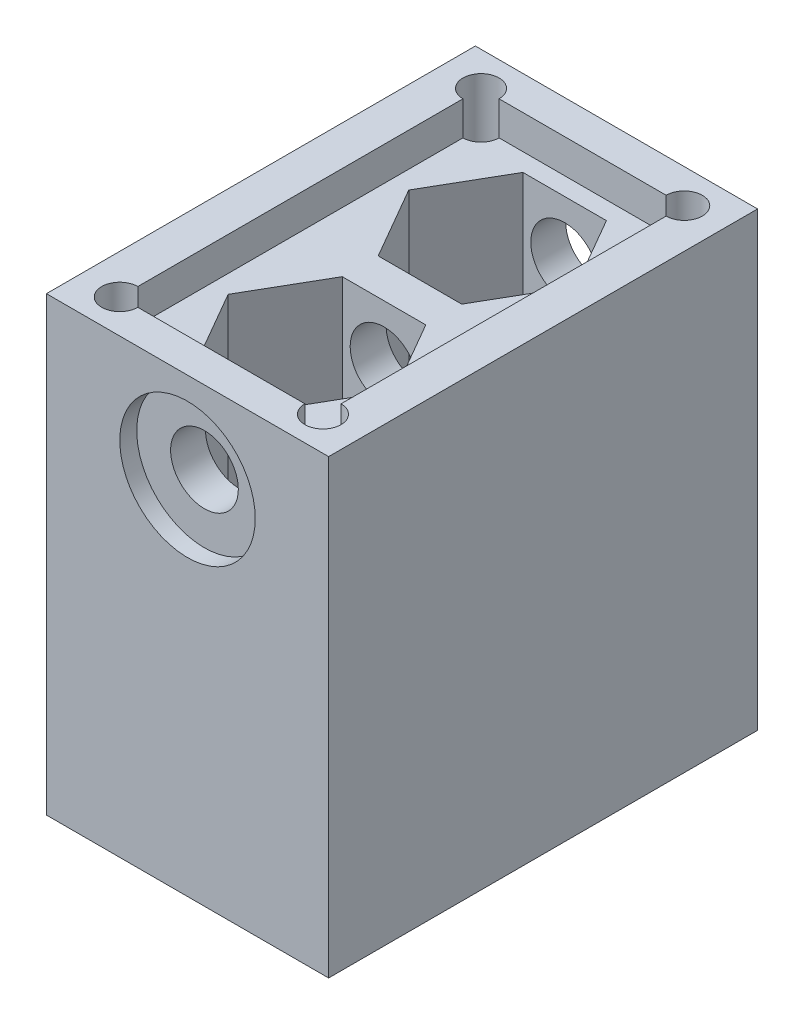
ISO-10303-21;
HEADER;
FILE_DESCRIPTION(('STEP AP214'),'2;1');
FILE_NAME('part.step','',(''),(''),'','','');
FILE_SCHEMA(('AUTOMOTIVE_DESIGN { 1 0 10303 214 1 1 1 1 }'));
ENDSEC;
DATA;
#1=APPLICATION_CONTEXT('core data for automotive mechanical design processes');
#2=APPLICATION_PROTOCOL_DEFINITION('international standard','automotive_design',2000,#1);
#3=PRODUCT_CONTEXT('',#1,'mechanical');
#4=PRODUCT('Part','Part','',(#3));
#5=PRODUCT_RELATED_PRODUCT_CATEGORY('part','',(#4));
#6=PRODUCT_DEFINITION_FORMATION('','',#4);
#7=PRODUCT_DEFINITION_CONTEXT('part definition',#1,'design');
#8=PRODUCT_DEFINITION('design','',#6,#7);
#9=PRODUCT_DEFINITION_SHAPE('','',#8);
#10=(LENGTH_UNIT() NAMED_UNIT(*) SI_UNIT(.MILLI.,.METRE.));
#11=(NAMED_UNIT(*) PLANE_ANGLE_UNIT() SI_UNIT($,.RADIAN.));
#12=(NAMED_UNIT(*) SI_UNIT($,.STERADIAN.) SOLID_ANGLE_UNIT());
#13=UNCERTAINTY_MEASURE_WITH_UNIT(LENGTH_MEASURE(1.E-05),#10,'distance_accuracy_value','');
#14=(GEOMETRIC_REPRESENTATION_CONTEXT(3) GLOBAL_UNCERTAINTY_ASSIGNED_CONTEXT((#13)) GLOBAL_UNIT_ASSIGNED_CONTEXT((#10,
#11,#12)) REPRESENTATION_CONTEXT('',''));
#15=CARTESIAN_POINT('',(0.,0.,0.));
#16=DIRECTION('',(0.,0.,1.));
#17=DIRECTION('',(1.,0.,0.));
#18=AXIS2_PLACEMENT_3D('',#15,#16,#17);
#19=CARTESIAN_POINT('',(0.,32.,-19.));
#20=DIRECTION('',(0.,0.,1.));
#21=DIRECTION('',(1.,0.,0.));
#22=AXIS2_PLACEMENT_3D('',#19,#20,#21);
#23=CYLINDRICAL_SURFACE('',#22,3.);
#24=CARTESIAN_POINT('',(0.,32.,14.4085879880048));
#25=DIRECTION('',(0.,0.,1.));
#26=DIRECTION('',(1.,0.,0.));
#27=AXIS2_PLACEMENT_3D('',#24,#25,#26);
#28=CIRCLE('',#27,3.);
#29=CARTESIAN_POINT('',(3.,32.,14.4085879880048));
#30=VERTEX_POINT('',#29);
#31=EDGE_CURVE('E319',#30,#30,#28,.F.);
#32=ORIENTED_EDGE('',*,*,#31,.T.);
#33=EDGE_LOOP('',(#32));
#34=FACE_BOUND('',#33,.T.);
#35=CARTESIAN_POINT('',(0.,32.,17.5));
#36=DIRECTION('',(0.,0.,1.));
#37=DIRECTION('',(1.,0.,0.));
#38=AXIS2_PLACEMENT_3D('',#35,#36,#37);
#39=CIRCLE('',#38,3.);
#40=CARTESIAN_POINT('',(3.,32.,17.5));
#41=VERTEX_POINT('',#40);
#42=EDGE_CURVE('E38',#41,#41,#39,.F.);
#43=ORIENTED_EDGE('',*,*,#42,.F.);
#44=EDGE_LOOP('',(#43));
#45=FACE_BOUND('',#44,.T.);
#46=ADVANCED_FACE('F34',(#34,#45),#23,.F.);
#47=CARTESIAN_POINT('',(0.,32.,-14.4085879880049));
#48=DIRECTION('',(0.,0.,-1.));
#49=DIRECTION('',(-1.,0.,0.));
#50=AXIS2_PLACEMENT_3D('',#47,#48,#49);
#51=CIRCLE('',#50,3.);
#52=CARTESIAN_POINT('',(-3.,32.,-14.4085879880049));
#53=VERTEX_POINT('',#52);
#54=EDGE_CURVE('E275',#53,#53,#51,.F.);
#55=ORIENTED_EDGE('',*,*,#54,.T.);
#56=EDGE_LOOP('',(#55));
#57=FACE_BOUND('',#56,.T.);
#58=CARTESIAN_POINT('',(0.,32.,-17.5));
#59=DIRECTION('',(0.,0.,-1.));
#60=DIRECTION('',(-1.,0.,0.));
#61=AXIS2_PLACEMENT_3D('',#58,#59,#60);
#62=CIRCLE('',#61,3.);
#63=CARTESIAN_POINT('',(-3.,32.,-17.5));
#64=VERTEX_POINT('',#63);
#65=EDGE_CURVE('E219',#64,#64,#62,.F.);
#66=ORIENTED_EDGE('',*,*,#65,.F.);
#67=EDGE_LOOP('',(#66));
#68=FACE_BOUND('',#67,.T.);
#69=ADVANCED_FACE('F480',(#57,#68),#23,.F.);
#70=CARTESIAN_POINT('',(3.70000000000001,22.,1.59141201199515));
#71=DIRECTION('',(0.,0.,-1.));
#72=DIRECTION('',(-1.,0.,0.));
#73=AXIS2_PLACEMENT_3D('',#70,#71,#72);
#74=PLANE('',#73);
#75=CARTESIAN_POINT('',(0.,32.,1.59141201199515));
#76=DIRECTION('',(0.,0.,-1.));
#77=DIRECTION('',(-1.,0.,0.));
#78=AXIS2_PLACEMENT_3D('',#75,#76,#77);
#79=CIRCLE('',#78,3.);
#80=CARTESIAN_POINT('',(-3.,32.,1.59141201199515));
#81=VERTEX_POINT('',#80);
#82=EDGE_CURVE('E315',#81,#81,#79,.F.);
#83=ORIENTED_EDGE('',*,*,#82,.F.);
#84=EDGE_LOOP('',(#83));
#85=FACE_BOUND('',#84,.T.);
#86=DIRECTION('',(1.,0.,0.));
#87=VECTOR('',#86,1.);
#88=CARTESIAN_POINT('',(3.70000000000001,37.,1.59141201199515));
#89=LINE('',#88,#87);
#90=CARTESIAN_POINT('',(-3.7,37.,1.59141201199515));
#91=VERTEX_POINT('',#90);
#92=CARTESIAN_POINT('',(3.70000000000001,37.,1.59141201199515));
#93=VERTEX_POINT('',#92);
#94=EDGE_CURVE('E421',#91,#93,#89,.T.);
#95=ORIENTED_EDGE('',*,*,#94,.F.);
#96=DIRECTION('',(0.,1.,0.));
#97=VECTOR('',#96,1.);
#98=CARTESIAN_POINT('',(-3.7,22.,1.59141201199515));
#99=LINE('',#98,#97);
#100=CARTESIAN_POINT('',(-3.7,22.,1.59141201199515));
#101=VERTEX_POINT('',#100);
#102=EDGE_CURVE('E301',#101,#91,#99,.T.);
#103=ORIENTED_EDGE('',*,*,#102,.F.);
#104=DIRECTION('',(-1.,0.,0.));
#105=VECTOR('',#104,1.);
#106=CARTESIAN_POINT('',(3.70000000000001,22.,1.59141201199515));
#107=LINE('',#106,#105);
#108=CARTESIAN_POINT('',(3.70000000000001,22.,1.59141201199515));
#109=VERTEX_POINT('',#108);
#110=EDGE_CURVE('E290',#109,#101,#107,.T.);
#111=ORIENTED_EDGE('',*,*,#110,.F.);
#112=DIRECTION('',(0.,1.,0.));
#113=VECTOR('',#112,1.);
#114=CARTESIAN_POINT('',(3.70000000000001,22.,1.59141201199515));
#115=LINE('',#114,#113);
#116=EDGE_CURVE('E304',#109,#93,#115,.T.);
#117=ORIENTED_EDGE('',*,*,#116,.T.);
#118=EDGE_LOOP('',(#95,#103,#111,#117));
#119=FACE_BOUND('',#118,.T.);
#120=ADVANCED_FACE('F487',(#85,#119),#74,.F.);
#121=CARTESIAN_POINT('',(-3.69999999999999,22.,14.4085879880048));
#122=DIRECTION('',(0.,0.,1.));
#123=DIRECTION('',(1.,0.,0.));
#124=AXIS2_PLACEMENT_3D('',#121,#122,#123);
#125=PLANE('',#124);
#126=ORIENTED_EDGE('',*,*,#31,.F.);
#127=EDGE_LOOP('',(#126));
#128=FACE_BOUND('',#127,.T.);
#129=DIRECTION('',(-1.,0.,0.));
#130=VECTOR('',#129,1.);
#131=CARTESIAN_POINT('',(-3.69999999999999,37.,14.4085879880048));
#132=LINE('',#131,#130);
#133=CARTESIAN_POINT('',(3.70000000000001,37.,14.4085879880048));
#134=VERTEX_POINT('',#133);
#135=CARTESIAN_POINT('',(-3.69999999999999,37.,14.4085879880048));
#136=VERTEX_POINT('',#135);
#137=EDGE_CURVE('E419',#134,#136,#132,.T.);
#138=ORIENTED_EDGE('',*,*,#137,.F.);
#139=DIRECTION('',(0.,1.,0.));
#140=VECTOR('',#139,1.);
#141=CARTESIAN_POINT('',(3.70000000000001,22.,14.4085879880048));
#142=LINE('',#141,#140);
#143=CARTESIAN_POINT('',(3.70000000000001,22.,14.4085879880048));
#144=VERTEX_POINT('',#143);
#145=EDGE_CURVE('E310',#144,#134,#142,.T.);
#146=ORIENTED_EDGE('',*,*,#145,.F.);
#147=DIRECTION('',(1.,0.,0.));
#148=VECTOR('',#147,1.);
#149=CARTESIAN_POINT('',(-3.69999999999999,22.,14.4085879880048));
#150=LINE('',#149,#148);
#151=CARTESIAN_POINT('',(-3.69999999999999,22.,14.4085879880048));
#152=VERTEX_POINT('',#151);
#153=EDGE_CURVE('E281',#152,#144,#150,.T.);
#154=ORIENTED_EDGE('',*,*,#153,.F.);
#155=DIRECTION('',(0.,1.,0.));
#156=VECTOR('',#155,1.);
#157=CARTESIAN_POINT('',(-3.69999999999999,22.,14.4085879880048));
#158=LINE('',#157,#156);
#159=EDGE_CURVE('E296',#152,#136,#158,.T.);
#160=ORIENTED_EDGE('',*,*,#159,.T.);
#161=EDGE_LOOP('',(#138,#146,#154,#160));
#162=FACE_BOUND('',#161,.T.);
#163=ADVANCED_FACE('F509',(#128,#162),#125,.F.);
#164=CARTESIAN_POINT('',(-7.4,22.,7.99999999999999));
#165=DIRECTION('',(-0.866025403784439,0.,0.5));
#166=DIRECTION('',(0.5,0.,0.866025403784439));
#167=AXIS2_PLACEMENT_3D('',#164,#165,#166);
#168=PLANE('',#167);
#169=DIRECTION('',(-0.5,0.,-0.866025403784439));
#170=VECTOR('',#169,1.);
#171=CARTESIAN_POINT('',(-7.4,37.,7.99999999999999));
#172=LINE('',#171,#170);
#173=CARTESIAN_POINT('',(-7.4,37.,7.99999999999999));
#174=VERTEX_POINT('',#173);
#175=EDGE_CURVE('E425',#136,#174,#172,.T.);
#176=ORIENTED_EDGE('',*,*,#175,.F.);
#177=ORIENTED_EDGE('',*,*,#159,.F.);
#178=DIRECTION('',(0.5,0.,0.866025403784439));
#179=VECTOR('',#178,1.);
#180=CARTESIAN_POINT('',(-7.4,22.,7.99999999999999));
#181=LINE('',#180,#179);
#182=CARTESIAN_POINT('',(-7.4,22.,7.99999999999999));
#183=VERTEX_POINT('',#182);
#184=EDGE_CURVE('E278',#183,#152,#181,.T.);
#185=ORIENTED_EDGE('',*,*,#184,.F.);
#186=DIRECTION('',(0.,1.,0.));
#187=VECTOR('',#186,1.);
#188=CARTESIAN_POINT('',(-7.4,22.,7.99999999999999));
#189=LINE('',#188,#187);
#190=EDGE_CURVE('E297',#183,#174,#189,.T.);
#191=ORIENTED_EDGE('',*,*,#190,.T.);
#192=EDGE_LOOP('',(#176,#177,#185,#191));
#193=FACE_BOUND('',#192,.T.);
#194=ADVANCED_FACE('F532',(#193),#168,.F.);
#195=CARTESIAN_POINT('',(-3.7,22.,1.59141201199515));
#196=DIRECTION('',(-0.866025403784438,0.,-0.5));
#197=DIRECTION('',(-0.5,0.,0.866025403784438));
#198=AXIS2_PLACEMENT_3D('',#195,#196,#197);
#199=PLANE('',#198);
#200=DIRECTION('',(0.5,0.,-0.866025403784438));
#201=VECTOR('',#200,1.);
#202=CARTESIAN_POINT('',(-3.7,37.,1.59141201199515));
#203=LINE('',#202,#201);
#204=EDGE_CURVE('E423',#174,#91,#203,.T.);
#205=ORIENTED_EDGE('',*,*,#204,.F.);
#206=ORIENTED_EDGE('',*,*,#190,.F.);
#207=DIRECTION('',(-0.5,0.,0.866025403784438));
#208=VECTOR('',#207,1.);
#209=CARTESIAN_POINT('',(-3.7,22.,1.59141201199515));
#210=LINE('',#209,#208);
#211=EDGE_CURVE('E293',#101,#183,#210,.T.);
#212=ORIENTED_EDGE('',*,*,#211,.F.);
#213=ORIENTED_EDGE('',*,*,#102,.T.);
#214=EDGE_LOOP('',(#205,#206,#212,#213));
#215=FACE_BOUND('',#214,.T.);
#216=ADVANCED_FACE('F516',(#215),#199,.F.);
#217=CARTESIAN_POINT('',(7.40000000000001,22.,8.));
#218=DIRECTION('',(0.866025403784439,0.,-0.5));
#219=DIRECTION('',(-0.5,0.,-0.866025403784439));
#220=AXIS2_PLACEMENT_3D('',#217,#218,#219);
#221=PLANE('',#220);
#222=DIRECTION('',(0.5,0.,0.866025403784439));
#223=VECTOR('',#222,1.);
#224=CARTESIAN_POINT('',(7.40000000000001,37.,8.));
#225=LINE('',#224,#223);
#226=CARTESIAN_POINT('',(7.40000000000001,37.,8.));
#227=VERTEX_POINT('',#226);
#228=EDGE_CURVE('E51',#93,#227,#225,.T.);
#229=ORIENTED_EDGE('',*,*,#228,.F.);
#230=ORIENTED_EDGE('',*,*,#116,.F.);
#231=DIRECTION('',(-0.5,0.,-0.866025403784439));
#232=VECTOR('',#231,1.);
#233=CARTESIAN_POINT('',(7.40000000000001,22.,8.));
#234=LINE('',#233,#232);
#235=CARTESIAN_POINT('',(7.40000000000001,22.,8.));
#236=VERTEX_POINT('',#235);
#237=EDGE_CURVE('E287',#236,#109,#234,.T.);
#238=ORIENTED_EDGE('',*,*,#237,.F.);
#239=DIRECTION('',(0.,1.,0.));
#240=VECTOR('',#239,1.);
#241=CARTESIAN_POINT('',(7.40000000000001,22.,8.));
#242=LINE('',#241,#240);
#243=EDGE_CURVE('E307',#236,#227,#242,.T.);
#244=ORIENTED_EDGE('',*,*,#243,.T.);
#245=EDGE_LOOP('',(#229,#230,#238,#244));
#246=FACE_BOUND('',#245,.T.);
#247=ADVANCED_FACE('F524',(#246),#221,.F.);
#248=CARTESIAN_POINT('',(3.70000000000001,22.,14.4085879880048));
#249=DIRECTION('',(0.866025403784439,0.,0.5));
#250=DIRECTION('',(0.5,0.,-0.866025403784439));
#251=AXIS2_PLACEMENT_3D('',#248,#249,#250);
#252=PLANE('',#251);
#253=DIRECTION('',(-0.5,0.,0.866025403784439));
#254=VECTOR('',#253,1.);
#255=CARTESIAN_POINT('',(3.70000000000001,37.,14.4085879880048));
#256=LINE('',#255,#254);
#257=EDGE_CURVE('E416',#227,#134,#256,.T.);
#258=ORIENTED_EDGE('',*,*,#257,.F.);
#259=ORIENTED_EDGE('',*,*,#243,.F.);
#260=DIRECTION('',(0.5,0.,-0.866025403784439));
#261=VECTOR('',#260,1.);
#262=CARTESIAN_POINT('',(3.70000000000001,22.,14.4085879880048));
#263=LINE('',#262,#261);
#264=EDGE_CURVE('E284',#144,#236,#263,.T.);
#265=ORIENTED_EDGE('',*,*,#264,.F.);
#266=ORIENTED_EDGE('',*,*,#145,.T.);
#267=EDGE_LOOP('',(#258,#259,#265,#266));
#268=FACE_BOUND('',#267,.T.);
#269=ADVANCED_FACE('F526',(#268),#252,.F.);
#270=CARTESIAN_POINT('',(3.70000000000001,22.,-14.4085879880049));
#271=DIRECTION('',(0.,0.,-1.));
#272=DIRECTION('',(-1.,0.,0.));
#273=AXIS2_PLACEMENT_3D('',#270,#271,#272);
#274=PLANE('',#273);
#275=ORIENTED_EDGE('',*,*,#54,.F.);
#276=EDGE_LOOP('',(#275));
#277=FACE_BOUND('',#276,.T.);
#278=DIRECTION('',(1.,0.,0.));
#279=VECTOR('',#278,1.);
#280=CARTESIAN_POINT('',(3.70000000000001,37.,-14.4085879880049));
#281=LINE('',#280,#279);
#282=CARTESIAN_POINT('',(-3.7,37.,-14.4085879880049));
#283=VERTEX_POINT('',#282);
#284=CARTESIAN_POINT('',(3.70000000000001,37.,-14.4085879880049));
#285=VERTEX_POINT('',#284);
#286=EDGE_CURVE('E410',#283,#285,#281,.T.);
#287=ORIENTED_EDGE('',*,*,#286,.F.);
#288=DIRECTION('',(0.,1.,0.));
#289=VECTOR('',#288,1.);
#290=CARTESIAN_POINT('',(-3.7,22.,-14.4085879880049));
#291=LINE('',#290,#289);
#292=CARTESIAN_POINT('',(-3.7,22.,-14.4085879880049));
#293=VERTEX_POINT('',#292);
#294=EDGE_CURVE('E253',#293,#283,#291,.T.);
#295=ORIENTED_EDGE('',*,*,#294,.F.);
#296=DIRECTION('',(-1.,0.,0.));
#297=VECTOR('',#296,1.);
#298=CARTESIAN_POINT('',(3.70000000000001,22.,-14.4085879880049));
#299=LINE('',#298,#297);
#300=CARTESIAN_POINT('',(3.70000000000001,22.,-14.4085879880049));
#301=VERTEX_POINT('',#300);
#302=EDGE_CURVE('E229',#301,#293,#299,.T.);
#303=ORIENTED_EDGE('',*,*,#302,.F.);
#304=DIRECTION('',(0.,1.,0.));
#305=VECTOR('',#304,1.);
#306=CARTESIAN_POINT('',(3.70000000000001,22.,-14.4085879880049));
#307=LINE('',#306,#305);
#308=EDGE_CURVE('E254',#301,#285,#307,.T.);
#309=ORIENTED_EDGE('',*,*,#308,.T.);
#310=EDGE_LOOP('',(#287,#295,#303,#309));
#311=FACE_BOUND('',#310,.T.);
#312=ADVANCED_FACE('F581',(#277,#311),#274,.F.);
#313=CARTESIAN_POINT('',(-3.70000000000001,22.,-1.59141201199515));
#314=DIRECTION('',(0.,0.,1.));
#315=DIRECTION('',(1.,0.,0.));
#316=AXIS2_PLACEMENT_3D('',#313,#314,#315);
#317=PLANE('',#316);
#318=CARTESIAN_POINT('',(0.,32.,-1.59141201199515));
#319=DIRECTION('',(0.,0.,1.));
#320=DIRECTION('',(1.,0.,0.));
#321=AXIS2_PLACEMENT_3D('',#318,#319,#320);
#322=CIRCLE('',#321,3.);
#323=CARTESIAN_POINT('',(3.,32.,-1.59141201199515));
#324=VERTEX_POINT('',#323);
#325=EDGE_CURVE('E272',#324,#324,#322,.F.);
#326=ORIENTED_EDGE('',*,*,#325,.F.);
#327=EDGE_LOOP('',(#326));
#328=FACE_BOUND('',#327,.T.);
#329=DIRECTION('',(-1.,0.,0.));
#330=VECTOR('',#329,1.);
#331=CARTESIAN_POINT('',(-3.70000000000001,37.,-1.59141201199515));
#332=LINE('',#331,#330);
#333=CARTESIAN_POINT('',(3.7,37.,-1.59141201199515));
#334=VERTEX_POINT('',#333);
#335=CARTESIAN_POINT('',(-3.70000000000001,37.,-1.59141201199515));
#336=VERTEX_POINT('',#335);
#337=EDGE_CURVE('E408',#334,#336,#332,.T.);
#338=ORIENTED_EDGE('',*,*,#337,.F.);
#339=DIRECTION('',(0.,1.,0.));
#340=VECTOR('',#339,1.);
#341=CARTESIAN_POINT('',(3.7,22.,-1.59141201199515));
#342=LINE('',#341,#340);
#343=CARTESIAN_POINT('',(3.7,22.,-1.59141201199515));
#344=VERTEX_POINT('',#343);
#345=EDGE_CURVE('E261',#344,#334,#342,.T.);
#346=ORIENTED_EDGE('',*,*,#345,.F.);
#347=DIRECTION('',(1.,0.,0.));
#348=VECTOR('',#347,1.);
#349=CARTESIAN_POINT('',(-3.70000000000001,22.,-1.59141201199515));
#350=LINE('',#349,#348);
#351=CARTESIAN_POINT('',(-3.70000000000001,22.,-1.59141201199515));
#352=VERTEX_POINT('',#351);
#353=EDGE_CURVE('E244',#352,#344,#350,.T.);
#354=ORIENTED_EDGE('',*,*,#353,.F.);
#355=DIRECTION('',(0.,1.,0.));
#356=VECTOR('',#355,1.);
#357=CARTESIAN_POINT('',(-3.70000000000001,22.,-1.59141201199515));
#358=LINE('',#357,#356);
#359=EDGE_CURVE('E264',#352,#336,#358,.T.);
#360=ORIENTED_EDGE('',*,*,#359,.T.);
#361=EDGE_LOOP('',(#338,#346,#354,#360));
#362=FACE_BOUND('',#361,.T.);
#363=ADVANCED_FACE('F574',(#328,#362),#317,.F.);
#364=CARTESIAN_POINT('',(7.40000000000001,22.,-8.));
#365=DIRECTION('',(0.866025403784439,0.,-0.5));
#366=DIRECTION('',(-0.5,0.,-0.866025403784439));
#367=AXIS2_PLACEMENT_3D('',#364,#365,#366);
#368=PLANE('',#367);
#369=DIRECTION('',(0.5,0.,0.866025403784439));
#370=VECTOR('',#369,1.);
#371=CARTESIAN_POINT('',(7.40000000000001,37.,-8.));
#372=LINE('',#371,#370);
#373=CARTESIAN_POINT('',(7.40000000000001,37.,-8.));
#374=VERTEX_POINT('',#373);
#375=EDGE_CURVE('E414',#285,#374,#372,.T.);
#376=ORIENTED_EDGE('',*,*,#375,.F.);
#377=ORIENTED_EDGE('',*,*,#308,.F.);
#378=DIRECTION('',(-0.5,0.,-0.866025403784439));
#379=VECTOR('',#378,1.);
#380=CARTESIAN_POINT('',(7.40000000000001,22.,-8.));
#381=LINE('',#380,#379);
#382=CARTESIAN_POINT('',(7.40000000000001,22.,-8.));
#383=VERTEX_POINT('',#382);
#384=EDGE_CURVE('E250',#383,#301,#381,.T.);
#385=ORIENTED_EDGE('',*,*,#384,.F.);
#386=DIRECTION('',(0.,1.,0.));
#387=VECTOR('',#386,1.);
#388=CARTESIAN_POINT('',(7.40000000000001,22.,-8.));
#389=LINE('',#388,#387);
#390=EDGE_CURVE('E258',#383,#374,#389,.T.);
#391=ORIENTED_EDGE('',*,*,#390,.T.);
#392=EDGE_LOOP('',(#376,#377,#385,#391));
#393=FACE_BOUND('',#392,.T.);
#394=ADVANCED_FACE('F570',(#393),#368,.F.);
#395=CARTESIAN_POINT('',(3.7,22.,-1.59141201199515));
#396=DIRECTION('',(0.866025403784438,0.,0.5));
#397=DIRECTION('',(0.5,0.,-0.866025403784438));
#398=AXIS2_PLACEMENT_3D('',#395,#396,#397);
#399=PLANE('',#398);
#400=DIRECTION('',(-0.5,0.,0.866025403784438));
#401=VECTOR('',#400,1.);
#402=CARTESIAN_POINT('',(3.7,37.,-1.59141201199515));
#403=LINE('',#402,#401);
#404=EDGE_CURVE('E412',#374,#334,#403,.T.);
#405=ORIENTED_EDGE('',*,*,#404,.F.);
#406=ORIENTED_EDGE('',*,*,#390,.F.);
#407=DIRECTION('',(0.5,0.,-0.866025403784438));
#408=VECTOR('',#407,1.);
#409=CARTESIAN_POINT('',(3.7,22.,-1.59141201199515));
#410=LINE('',#409,#408);
#411=EDGE_CURVE('E247',#344,#383,#410,.T.);
#412=ORIENTED_EDGE('',*,*,#411,.F.);
#413=ORIENTED_EDGE('',*,*,#345,.T.);
#414=EDGE_LOOP('',(#405,#406,#412,#413));
#415=FACE_BOUND('',#414,.T.);
#416=ADVANCED_FACE('F573',(#415),#399,.F.);
#417=CARTESIAN_POINT('',(-7.40000000000001,22.,-8.));
#418=DIRECTION('',(-0.866025403784439,0.,0.5));
#419=DIRECTION('',(0.5,0.,0.866025403784439));
#420=AXIS2_PLACEMENT_3D('',#417,#418,#419);
#421=PLANE('',#420);
#422=DIRECTION('',(-0.5,0.,-0.866025403784439));
#423=VECTOR('',#422,1.);
#424=CARTESIAN_POINT('',(-7.40000000000001,37.,-8.));
#425=LINE('',#424,#423);
#426=CARTESIAN_POINT('',(-7.40000000000001,37.,-8.));
#427=VERTEX_POINT('',#426);
#428=EDGE_CURVE('E59',#336,#427,#425,.T.);
#429=ORIENTED_EDGE('',*,*,#428,.F.);
#430=ORIENTED_EDGE('',*,*,#359,.F.);
#431=DIRECTION('',(0.5,0.,0.866025403784439));
#432=VECTOR('',#431,1.);
#433=CARTESIAN_POINT('',(-7.40000000000001,22.,-8.));
#434=LINE('',#433,#432);
#435=CARTESIAN_POINT('',(-7.40000000000001,22.,-8.));
#436=VERTEX_POINT('',#435);
#437=EDGE_CURVE('E241',#436,#352,#434,.T.);
#438=ORIENTED_EDGE('',*,*,#437,.F.);
#439=DIRECTION('',(0.,1.,0.));
#440=VECTOR('',#439,1.);
#441=CARTESIAN_POINT('',(-7.40000000000001,22.,-8.));
#442=LINE('',#441,#440);
#443=EDGE_CURVE('E267',#436,#427,#442,.T.);
#444=ORIENTED_EDGE('',*,*,#443,.T.);
#445=EDGE_LOOP('',(#429,#430,#438,#444));
#446=FACE_BOUND('',#445,.T.);
#447=ADVANCED_FACE('F550',(#446),#421,.F.);
#448=CARTESIAN_POINT('',(-3.7,22.,-14.4085879880049));
#449=DIRECTION('',(-0.866025403784438,0.,-0.5));
#450=DIRECTION('',(-0.5,0.,0.866025403784439));
#451=AXIS2_PLACEMENT_3D('',#448,#449,#450);
#452=PLANE('',#451);
#453=DIRECTION('',(0.5,0.,-0.866025403784439));
#454=VECTOR('',#453,1.);
#455=CARTESIAN_POINT('',(-3.7,37.,-14.4085879880049));
#456=LINE('',#455,#454);
#457=EDGE_CURVE('E405',#427,#283,#456,.T.);
#458=ORIENTED_EDGE('',*,*,#457,.F.);
#459=ORIENTED_EDGE('',*,*,#443,.F.);
#460=DIRECTION('',(-0.5,0.,0.866025403784439));
#461=VECTOR('',#460,1.);
#462=CARTESIAN_POINT('',(-3.7,22.,-14.4085879880049));
#463=LINE('',#462,#461);
#464=EDGE_CURVE('E238',#293,#436,#463,.T.);
#465=ORIENTED_EDGE('',*,*,#464,.F.);
#466=ORIENTED_EDGE('',*,*,#294,.T.);
#467=EDGE_LOOP('',(#458,#459,#465,#466));
#468=FACE_BOUND('',#467,.T.);
#469=ADVANCED_FACE('F545',(#468),#452,.F.);
#470=CARTESIAN_POINT('',(0.,0.,-8.));
#471=DIRECTION('',(0.,1.,0.));
#472=DIRECTION('',(0.,0.,1.));
#473=AXIS2_PLACEMENT_3D('',#470,#471,#472);
#474=CYLINDRICAL_SURFACE('',#473,4.15);
#475=CARTESIAN_POINT('',(0.,0.,-8.));
#476=DIRECTION('',(0.,1.,0.));
#477=DIRECTION('',(0.,0.,1.));
#478=AXIS2_PLACEMENT_3D('',#475,#476,#477);
#479=CIRCLE('',#478,4.15);
#480=CARTESIAN_POINT('',(0.,0.,-3.85));
#481=VERTEX_POINT('',#480);
#482=EDGE_CURVE('E318',#481,#481,#479,.T.);
#483=ORIENTED_EDGE('',*,*,#482,.F.);
#484=EDGE_LOOP('',(#483));
#485=FACE_BOUND('',#484,.T.);
#486=CARTESIAN_POINT('',(0.,22.,-8.));
#487=DIRECTION('',(0.,1.,0.));
#488=DIRECTION('',(0.,0.,1.));
#489=AXIS2_PLACEMENT_3D('',#486,#487,#488);
#490=CIRCLE('',#489,4.15);
#491=CARTESIAN_POINT('',(0.,22.,-3.85));
#492=VERTEX_POINT('',#491);
#493=EDGE_CURVE('E257',#492,#492,#490,.F.);
#494=ORIENTED_EDGE('',*,*,#493,.F.);
#495=EDGE_LOOP('',(#494));
#496=FACE_BOUND('',#495,.T.);
#497=ADVANCED_FACE('F501',(#485,#496),#474,.F.);
#498=CARTESIAN_POINT('',(0.,0.,8.));
#499=DIRECTION('',(0.,1.,0.));
#500=DIRECTION('',(0.,0.,1.));
#501=AXIS2_PLACEMENT_3D('',#498,#499,#500);
#502=CYLINDRICAL_SURFACE('',#501,4.15);
#503=CARTESIAN_POINT('',(0.,0.,8.));
#504=DIRECTION('',(0.,1.,0.));
#505=DIRECTION('',(0.,0.,1.));
#506=AXIS2_PLACEMENT_3D('',#503,#504,#505);
#507=CIRCLE('',#506,4.15);
#508=CARTESIAN_POINT('',(0.,0.,12.15));
#509=VERTEX_POINT('',#508);
#510=EDGE_CURVE('E322',#509,#509,#507,.T.);
#511=ORIENTED_EDGE('',*,*,#510,.F.);
#512=EDGE_LOOP('',(#511));
#513=FACE_BOUND('',#512,.T.);
#514=CARTESIAN_POINT('',(0.,22.,8.));
#515=DIRECTION('',(0.,1.,0.));
#516=DIRECTION('',(0.,0.,1.));
#517=AXIS2_PLACEMENT_3D('',#514,#515,#516);
#518=CIRCLE('',#517,4.15);
#519=CARTESIAN_POINT('',(0.,22.,12.15));
#520=VERTEX_POINT('',#519);
#521=EDGE_CURVE('E300',#520,#520,#518,.F.);
#522=ORIENTED_EDGE('',*,*,#521,.F.);
#523=EDGE_LOOP('',(#522));
#524=FACE_BOUND('',#523,.T.);
#525=ADVANCED_FACE('F493',(#513,#524),#502,.F.);
#526=ORIENTED_EDGE('',*,*,#325,.T.);
#527=EDGE_LOOP('',(#526));
#528=FACE_BOUND('',#527,.T.);
#529=ORIENTED_EDGE('',*,*,#82,.T.);
#530=EDGE_LOOP('',(#529));
#531=FACE_BOUND('',#530,.T.);
#532=ADVANCED_FACE('F483',(#528,#531),#23,.F.);
#533=CARTESIAN_POINT('',(-12.5,40.,19.));
#534=DIRECTION('',(1.,0.,0.));
#535=DIRECTION('',(0.,0.,-1.));
#536=AXIS2_PLACEMENT_3D('',#533,#534,#535);
#537=PLANE('',#536);
#538=DIRECTION('',(0.,0.,1.));
#539=VECTOR('',#538,1.);
#540=CARTESIAN_POINT('',(-12.5,0.,19.));
#541=LINE('',#540,#539);
#542=CARTESIAN_POINT('',(-12.5,0.,-19.));
#543=VERTEX_POINT('',#542);
#544=CARTESIAN_POINT('',(-12.5,0.,19.));
#545=VERTEX_POINT('',#544);
#546=EDGE_CURVE('E325',#543,#545,#541,.T.);
#547=ORIENTED_EDGE('',*,*,#546,.T.);
#548=DIRECTION('',(0.,-1.,0.));
#549=VECTOR('',#548,1.);
#550=CARTESIAN_POINT('',(-12.5,40.,19.));
#551=LINE('',#550,#549);
#552=CARTESIAN_POINT('',(-12.5,40.,19.));
#553=VERTEX_POINT('',#552);
#554=EDGE_CURVE('E352',#553,#545,#551,.T.);
#555=ORIENTED_EDGE('',*,*,#554,.F.);
#556=DIRECTION('',(0.,0.,1.));
#557=VECTOR('',#556,1.);
#558=CARTESIAN_POINT('',(-12.5,40.,19.));
#559=LINE('',#558,#557);
#560=CARTESIAN_POINT('',(-12.5,40.,-19.));
#561=VERTEX_POINT('',#560);
#562=EDGE_CURVE('E326',#561,#553,#559,.T.);
#563=ORIENTED_EDGE('',*,*,#562,.F.);
#564=DIRECTION('',(0.,-1.,0.));
#565=VECTOR('',#564,1.);
#566=CARTESIAN_POINT('',(-12.5,40.,-19.));
#567=LINE('',#566,#565);
#568=EDGE_CURVE('E336',#561,#543,#567,.T.);
#569=ORIENTED_EDGE('',*,*,#568,.T.);
#570=EDGE_LOOP('',(#547,#555,#563,#569));
#571=FACE_BOUND('',#570,.T.);
#572=ADVANCED_FACE('F36',(#571),#537,.F.);
#573=CARTESIAN_POINT('',(12.5,40.,19.));
#574=DIRECTION('',(0.,0.,-1.));
#575=DIRECTION('',(-1.,0.,0.));
#576=AXIS2_PLACEMENT_3D('',#573,#574,#575);
#577=PLANE('',#576);
#578=CARTESIAN_POINT('',(0.,32.,19.));
#579=DIRECTION('',(0.,0.,1.));
#580=DIRECTION('',(1.,0.,0.));
#581=AXIS2_PLACEMENT_3D('',#578,#579,#580);
#582=CIRCLE('',#581,6.);
#583=CARTESIAN_POINT('',(6.,32.,19.));
#584=VERTEX_POINT('',#583);
#585=EDGE_CURVE('E382',#584,#584,#582,.T.);
#586=ORIENTED_EDGE('',*,*,#585,.F.);
#587=EDGE_LOOP('',(#586));
#588=FACE_BOUND('',#587,.T.);
#589=DIRECTION('',(1.,0.,0.));
#590=VECTOR('',#589,1.);
#591=CARTESIAN_POINT('',(12.5,0.,19.));
#592=LINE('',#591,#590);
#593=CARTESIAN_POINT('',(12.5,0.,19.));
#594=VERTEX_POINT('',#593);
#595=EDGE_CURVE('E339',#545,#594,#592,.T.);
#596=ORIENTED_EDGE('',*,*,#595,.T.);
#597=DIRECTION('',(0.,-1.,0.));
#598=VECTOR('',#597,1.);
#599=CARTESIAN_POINT('',(12.5,40.,19.));
#600=LINE('',#599,#598);
#601=CARTESIAN_POINT('',(12.5,40.,19.));
#602=VERTEX_POINT('',#601);
#603=EDGE_CURVE('E349',#602,#594,#600,.T.);
#604=ORIENTED_EDGE('',*,*,#603,.F.);
#605=DIRECTION('',(1.,0.,0.));
#606=VECTOR('',#605,1.);
#607=CARTESIAN_POINT('',(12.5,40.,19.));
#608=LINE('',#607,#606);
#609=EDGE_CURVE('E329',#553,#602,#608,.T.);
#610=ORIENTED_EDGE('',*,*,#609,.F.);
#611=ORIENTED_EDGE('',*,*,#554,.T.);
#612=EDGE_LOOP('',(#596,#604,#610,#611));
#613=FACE_BOUND('',#612,.T.);
#614=ADVANCED_FACE('F499',(#588,#613),#577,.F.);
#615=CARTESIAN_POINT('',(12.5,40.,19.));
#616=DIRECTION('',(-1.,0.,0.));
#617=DIRECTION('',(0.,0.,1.));
#618=AXIS2_PLACEMENT_3D('',#615,#616,#617);
#619=PLANE('',#618);
#620=DIRECTION('',(0.,0.,-1.));
#621=VECTOR('',#620,1.);
#622=CARTESIAN_POINT('',(12.5,0.,19.));
#623=LINE('',#622,#621);
#624=CARTESIAN_POINT('',(12.5,0.,-19.));
#625=VERTEX_POINT('',#624);
#626=EDGE_CURVE('E341',#594,#625,#623,.T.);
#627=ORIENTED_EDGE('',*,*,#626,.T.);
#628=DIRECTION('',(0.,-1.,0.));
#629=VECTOR('',#628,1.);
#630=CARTESIAN_POINT('',(12.5,40.,-19.));
#631=LINE('',#630,#629);
#632=CARTESIAN_POINT('',(12.5,40.,-19.));
#633=VERTEX_POINT('',#632);
#634=EDGE_CURVE('E346',#633,#625,#631,.T.);
#635=ORIENTED_EDGE('',*,*,#634,.F.);
#636=DIRECTION('',(0.,0.,-1.));
#637=VECTOR('',#636,1.);
#638=CARTESIAN_POINT('',(12.5,40.,19.));
#639=LINE('',#638,#637);
#640=EDGE_CURVE('E332',#602,#633,#639,.T.);
#641=ORIENTED_EDGE('',*,*,#640,.F.);
#642=ORIENTED_EDGE('',*,*,#603,.T.);
#643=EDGE_LOOP('',(#627,#635,#641,#642));
#644=FACE_BOUND('',#643,.T.);
#645=ADVANCED_FACE('F709',(#644),#619,.F.);
#646=CARTESIAN_POINT('',(12.5,40.,-19.));
#647=DIRECTION('',(0.,0.,1.));
#648=DIRECTION('',(1.,0.,0.));
#649=AXIS2_PLACEMENT_3D('',#646,#647,#648);
#650=PLANE('',#649);
#651=CARTESIAN_POINT('',(0.,32.,-19.));
#652=DIRECTION('',(0.,0.,-1.));
#653=DIRECTION('',(-1.,0.,0.));
#654=AXIS2_PLACEMENT_3D('',#651,#652,#653);
#655=CIRCLE('',#654,6.);
#656=CARTESIAN_POINT('',(-6.00000000000001,32.,-19.));
#657=VERTEX_POINT('',#656);
#658=EDGE_CURVE('E375',#657,#657,#655,.T.);
#659=ORIENTED_EDGE('',*,*,#658,.F.);
#660=EDGE_LOOP('',(#659));
#661=FACE_BOUND('',#660,.T.);
#662=DIRECTION('',(-1.,0.,0.));
#663=VECTOR('',#662,1.);
#664=CARTESIAN_POINT('',(12.5,0.,-19.));
#665=LINE('',#664,#663);
#666=EDGE_CURVE('E330',#625,#543,#665,.T.);
#667=ORIENTED_EDGE('',*,*,#666,.T.);
#668=ORIENTED_EDGE('',*,*,#568,.F.);
#669=DIRECTION('',(-1.,0.,0.));
#670=VECTOR('',#669,1.);
#671=CARTESIAN_POINT('',(12.5,40.,-19.));
#672=LINE('',#671,#670);
#673=EDGE_CURVE('E334',#633,#561,#672,.T.);
#674=ORIENTED_EDGE('',*,*,#673,.F.);
#675=ORIENTED_EDGE('',*,*,#634,.T.);
#676=EDGE_LOOP('',(#667,#668,#674,#675));
#677=FACE_BOUND('',#676,.T.);
#678=ADVANCED_FACE('F629',(#661,#677),#650,.F.);
#679=CARTESIAN_POINT('',(0.,40.,0.));
#680=DIRECTION('',(0.,1.,0.));
#681=DIRECTION('',(0.,0.,1.));
#682=AXIS2_PLACEMENT_3D('',#679,#680,#681);
#683=PLANE('',#682);
#684=DIRECTION('',(0.,0.,-1.));
#685=VECTOR('',#684,1.);
#686=CARTESIAN_POINT('',(9.,40.,-16.));
#687=LINE('',#686,#685);
#688=CARTESIAN_POINT('',(9.,40.,14.4));
#689=VERTEX_POINT('',#688);
#690=CARTESIAN_POINT('',(9.,40.,-14.4));
#691=VERTEX_POINT('',#690);
#692=EDGE_CURVE('E200',#689,#691,#687,.T.);
#693=ORIENTED_EDGE('',*,*,#692,.F.);
#694=CARTESIAN_POINT('',(9.,40.,16.));
#695=DIRECTION('',(0.,1.,0.));
#696=DIRECTION('',(0.,0.,1.));
#697=AXIS2_PLACEMENT_3D('',#694,#695,#696);
#698=CIRCLE('',#697,1.6);
#699=CARTESIAN_POINT('',(7.4,40.,16.));
#700=VERTEX_POINT('',#699);
#701=EDGE_CURVE('E215',#700,#689,#698,.T.);
#702=ORIENTED_EDGE('',*,*,#701,.F.);
#703=DIRECTION('',(1.,0.,0.));
#704=VECTOR('',#703,1.);
#705=CARTESIAN_POINT('',(-9.,40.,16.));
#706=LINE('',#705,#704);
#707=CARTESIAN_POINT('',(-7.4,40.,16.));
#708=VERTEX_POINT('',#707);
#709=EDGE_CURVE('E387',#708,#700,#706,.T.);
#710=ORIENTED_EDGE('',*,*,#709,.F.);
#711=CARTESIAN_POINT('',(-9.,40.,16.));
#712=DIRECTION('',(0.,1.,0.));
#713=DIRECTION('',(0.,0.,1.));
#714=AXIS2_PLACEMENT_3D('',#711,#712,#713);
#715=CIRCLE('',#714,1.6);
#716=CARTESIAN_POINT('',(-9.,40.,14.4));
#717=VERTEX_POINT('',#716);
#718=EDGE_CURVE('E232',#717,#708,#715,.T.);
#719=ORIENTED_EDGE('',*,*,#718,.F.);
#720=DIRECTION('',(0.,0.,1.));
#721=VECTOR('',#720,1.);
#722=CARTESIAN_POINT('',(-9.,40.,-16.));
#723=LINE('',#722,#721);
#724=CARTESIAN_POINT('',(-9.,40.,-14.4));
#725=VERTEX_POINT('',#724);
#726=EDGE_CURVE('E397',#725,#717,#723,.T.);
#727=ORIENTED_EDGE('',*,*,#726,.F.);
#728=CARTESIAN_POINT('',(-9.,40.,-16.));
#729=DIRECTION('',(0.,1.,0.));
#730=DIRECTION('',(0.,0.,1.));
#731=AXIS2_PLACEMENT_3D('',#728,#729,#730);
#732=CIRCLE('',#731,1.6);
#733=CARTESIAN_POINT('',(-7.4,40.,-16.));
#734=VERTEX_POINT('',#733);
#735=EDGE_CURVE('E438',#734,#725,#732,.T.);
#736=ORIENTED_EDGE('',*,*,#735,.F.);
#737=DIRECTION('',(-1.,0.,0.));
#738=VECTOR('',#737,1.);
#739=CARTESIAN_POINT('',(-9.,40.,-16.));
#740=LINE('',#739,#738);
#741=CARTESIAN_POINT('',(7.39999999999999,40.,-16.));
#742=VERTEX_POINT('',#741);
#743=EDGE_CURVE('E218',#742,#734,#740,.T.);
#744=ORIENTED_EDGE('',*,*,#743,.F.);
#745=CARTESIAN_POINT('',(8.99999999999999,40.,-16.));
#746=DIRECTION('',(0.,1.,0.));
#747=DIRECTION('',(0.,0.,1.));
#748=AXIS2_PLACEMENT_3D('',#745,#746,#747);
#749=CIRCLE('',#748,1.6);
#750=EDGE_CURVE('E206',#691,#742,#749,.T.);
#751=ORIENTED_EDGE('',*,*,#750,.F.);
#752=EDGE_LOOP('',(#693,#702,#710,#719,#727,#736,#744,#751));
#753=FACE_BOUND('',#752,.T.);
#754=ORIENTED_EDGE('',*,*,#562,.T.);
#755=ORIENTED_EDGE('',*,*,#609,.T.);
#756=ORIENTED_EDGE('',*,*,#640,.T.);
#757=ORIENTED_EDGE('',*,*,#673,.T.);
#758=EDGE_LOOP('',(#754,#755,#756,#757));
#759=FACE_BOUND('',#758,.T.);
#760=ADVANCED_FACE('F212',(#753,#759),#683,.T.);
#761=CARTESIAN_POINT('',(0.,0.,0.));
#762=DIRECTION('',(0.,1.,0.));
#763=DIRECTION('',(0.,0.,1.));
#764=AXIS2_PLACEMENT_3D('',#761,#762,#763);
#765=PLANE('',#764);
#766=CARTESIAN_POINT('',(-9.,0.,16.));
#767=DIRECTION('',(0.,1.,0.));
#768=DIRECTION('',(0.,0.,1.));
#769=AXIS2_PLACEMENT_3D('',#766,#767,#768);
#770=CIRCLE('',#769,1.6);
#771=CARTESIAN_POINT('',(-9.,0.,17.6));
#772=VERTEX_POINT('',#771);
#773=EDGE_CURVE('E226',#772,#772,#770,.T.);
#774=ORIENTED_EDGE('',*,*,#773,.T.);
#775=EDGE_LOOP('',(#774));
#776=FACE_BOUND('',#775,.T.);
#777=CARTESIAN_POINT('',(-9.,0.,-16.));
#778=DIRECTION('',(0.,1.,0.));
#779=DIRECTION('',(0.,0.,1.));
#780=AXIS2_PLACEMENT_3D('',#777,#778,#779);
#781=CIRCLE('',#780,1.6);
#782=CARTESIAN_POINT('',(-9.,0.,-14.4));
#783=VERTEX_POINT('',#782);
#784=EDGE_CURVE('E435',#783,#783,#781,.T.);
#785=ORIENTED_EDGE('',*,*,#784,.T.);
#786=EDGE_LOOP('',(#785));
#787=FACE_BOUND('',#786,.T.);
#788=CARTESIAN_POINT('',(8.99999999999999,0.,-16.));
#789=DIRECTION('',(0.,1.,0.));
#790=DIRECTION('',(0.,0.,1.));
#791=AXIS2_PLACEMENT_3D('',#788,#789,#790);
#792=CIRCLE('',#791,1.6);
#793=CARTESIAN_POINT('',(8.99999999999999,0.,-14.4));
#794=VERTEX_POINT('',#793);
#795=EDGE_CURVE('E441',#794,#794,#792,.T.);
#796=ORIENTED_EDGE('',*,*,#795,.T.);
#797=EDGE_LOOP('',(#796));
#798=FACE_BOUND('',#797,.T.);
#799=CARTESIAN_POINT('',(9.,0.,16.));
#800=DIRECTION('',(0.,1.,0.));
#801=DIRECTION('',(0.,0.,1.));
#802=AXIS2_PLACEMENT_3D('',#799,#800,#801);
#803=CIRCLE('',#802,1.6);
#804=CARTESIAN_POINT('',(9.,0.,17.6));
#805=VERTEX_POINT('',#804);
#806=EDGE_CURVE('E225',#805,#805,#803,.T.);
#807=ORIENTED_EDGE('',*,*,#806,.T.);
#808=EDGE_LOOP('',(#807));
#809=FACE_BOUND('',#808,.T.);
#810=ORIENTED_EDGE('',*,*,#482,.T.);
#811=EDGE_LOOP('',(#810));
#812=FACE_BOUND('',#811,.T.);
#813=ORIENTED_EDGE('',*,*,#510,.T.);
#814=EDGE_LOOP('',(#813));
#815=FACE_BOUND('',#814,.T.);
#816=ORIENTED_EDGE('',*,*,#546,.F.);
#817=ORIENTED_EDGE('',*,*,#666,.F.);
#818=ORIENTED_EDGE('',*,*,#626,.F.);
#819=ORIENTED_EDGE('',*,*,#595,.F.);
#820=EDGE_LOOP('',(#816,#817,#818,#819));
#821=FACE_BOUND('',#820,.T.);
#822=ADVANCED_FACE('F566',(#776,#787,#798,#809,#812,#815,#821),#765,.F.);
#823=CARTESIAN_POINT('',(0.,22.,0.));
#824=DIRECTION('',(0.,1.,0.));
#825=DIRECTION('',(0.,0.,1.));
#826=AXIS2_PLACEMENT_3D('',#823,#824,#825);
#827=PLANE('',#826);
#828=ORIENTED_EDGE('',*,*,#184,.T.);
#829=ORIENTED_EDGE('',*,*,#153,.T.);
#830=ORIENTED_EDGE('',*,*,#264,.T.);
#831=ORIENTED_EDGE('',*,*,#237,.T.);
#832=ORIENTED_EDGE('',*,*,#110,.T.);
#833=ORIENTED_EDGE('',*,*,#211,.T.);
#834=EDGE_LOOP('',(#828,#829,#830,#831,#832,#833));
#835=FACE_BOUND('',#834,.T.);
#836=ORIENTED_EDGE('',*,*,#521,.T.);
#837=EDGE_LOOP('',(#836));
#838=FACE_BOUND('',#837,.T.);
#839=ADVANCED_FACE('F519',(#835,#838),#827,.T.);
#840=CARTESIAN_POINT('',(0.,22.,0.));
#841=DIRECTION('',(0.,1.,0.));
#842=DIRECTION('',(0.,0.,1.));
#843=AXIS2_PLACEMENT_3D('',#840,#841,#842);
#844=PLANE('',#843);
#845=ORIENTED_EDGE('',*,*,#302,.T.);
#846=ORIENTED_EDGE('',*,*,#464,.T.);
#847=ORIENTED_EDGE('',*,*,#437,.T.);
#848=ORIENTED_EDGE('',*,*,#353,.T.);
#849=ORIENTED_EDGE('',*,*,#411,.T.);
#850=ORIENTED_EDGE('',*,*,#384,.T.);
#851=EDGE_LOOP('',(#845,#846,#847,#848,#849,#850));
#852=FACE_BOUND('',#851,.T.);
#853=ORIENTED_EDGE('',*,*,#493,.T.);
#854=EDGE_LOOP('',(#853));
#855=FACE_BOUND('',#854,.T.);
#856=ADVANCED_FACE('F557',(#852,#855),#844,.T.);
#857=CARTESIAN_POINT('',(9.,0.,16.));
#858=DIRECTION('',(0.,1.,0.));
#859=DIRECTION('',(0.,0.,1.));
#860=AXIS2_PLACEMENT_3D('',#857,#858,#859);
#861=CYLINDRICAL_SURFACE('',#860,1.6);
#862=ORIENTED_EDGE('',*,*,#701,.T.);
#863=DIRECTION('',(0.,1.,0.));
#864=VECTOR('',#863,1.);
#865=CARTESIAN_POINT('',(9.,0.,14.4));
#866=LINE('',#865,#864);
#867=CARTESIAN_POINT('',(9.,37.,14.4));
#868=VERTEX_POINT('',#867);
#869=EDGE_CURVE('E197',#689,#868,#866,.F.);
#870=ORIENTED_EDGE('',*,*,#869,.T.);
#871=CARTESIAN_POINT('',(9.,37.,16.));
#872=DIRECTION('',(0.,1.,0.));
#873=DIRECTION('',(0.,0.,1.));
#874=AXIS2_PLACEMENT_3D('',#871,#872,#873);
#875=CIRCLE('',#874,1.6);
#876=CARTESIAN_POINT('',(7.4,37.,16.));
#877=VERTEX_POINT('',#876);
#878=EDGE_CURVE('E403',#877,#868,#875,.F.);
#879=ORIENTED_EDGE('',*,*,#878,.F.);
#880=DIRECTION('',(0.,1.,0.));
#881=VECTOR('',#880,1.);
#882=CARTESIAN_POINT('',(7.4,0.,16.));
#883=LINE('',#882,#881);
#884=EDGE_CURVE('E224',#877,#700,#883,.T.);
#885=ORIENTED_EDGE('',*,*,#884,.T.);
#886=EDGE_LOOP('',(#862,#870,#879,#885));
#887=FACE_BOUND('',#886,.T.);
#888=ORIENTED_EDGE('',*,*,#806,.F.);
#889=EDGE_LOOP('',(#888));
#890=FACE_BOUND('',#889,.T.);
#891=ADVANCED_FACE('F222',(#887,#890),#861,.F.);
#892=CARTESIAN_POINT('',(8.99999999999999,0.,-16.));
#893=DIRECTION('',(0.,1.,0.));
#894=DIRECTION('',(0.,0.,1.));
#895=AXIS2_PLACEMENT_3D('',#892,#893,#894);
#896=CYLINDRICAL_SURFACE('',#895,1.6);
#897=ORIENTED_EDGE('',*,*,#795,.F.);
#898=EDGE_LOOP('',(#897));
#899=FACE_BOUND('',#898,.T.);
#900=CARTESIAN_POINT('',(8.99999999999999,37.,-16.));
#901=DIRECTION('',(0.,1.,0.));
#902=DIRECTION('',(0.,0.,1.));
#903=AXIS2_PLACEMENT_3D('',#900,#901,#902);
#904=CIRCLE('',#903,1.6);
#905=CARTESIAN_POINT('',(9.,37.,-14.4));
#906=VERTEX_POINT('',#905);
#907=CARTESIAN_POINT('',(7.39999999999999,37.,-16.));
#908=VERTEX_POINT('',#907);
#909=EDGE_CURVE('E401',#906,#908,#904,.F.);
#910=ORIENTED_EDGE('',*,*,#909,.F.);
#911=DIRECTION('',(0.,1.,0.));
#912=VECTOR('',#911,1.);
#913=CARTESIAN_POINT('',(9.,0.,-14.4));
#914=LINE('',#913,#912);
#915=EDGE_CURVE('E11',#906,#691,#914,.T.);
#916=ORIENTED_EDGE('',*,*,#915,.T.);
#917=ORIENTED_EDGE('',*,*,#750,.T.);
#918=DIRECTION('',(0.,1.,0.));
#919=VECTOR('',#918,1.);
#920=CARTESIAN_POINT('',(7.39999999999999,0.,-16.));
#921=LINE('',#920,#919);
#922=EDGE_CURVE('E207',#742,#908,#921,.F.);
#923=ORIENTED_EDGE('',*,*,#922,.T.);
#924=EDGE_LOOP('',(#910,#916,#917,#923));
#925=FACE_BOUND('',#924,.T.);
#926=ADVANCED_FACE('F445',(#899,#925),#896,.F.);
#927=CARTESIAN_POINT('',(-9.,0.,-16.));
#928=DIRECTION('',(0.,1.,0.));
#929=DIRECTION('',(0.,0.,1.));
#930=AXIS2_PLACEMENT_3D('',#927,#928,#929);
#931=CYLINDRICAL_SURFACE('',#930,1.6);
#932=ORIENTED_EDGE('',*,*,#735,.T.);
#933=DIRECTION('',(0.,1.,0.));
#934=VECTOR('',#933,1.);
#935=CARTESIAN_POINT('',(-9.,0.,-14.4));
#936=LINE('',#935,#934);
#937=CARTESIAN_POINT('',(-9.,37.,-14.4));
#938=VERTEX_POINT('',#937);
#939=EDGE_CURVE('E427',#725,#938,#936,.F.);
#940=ORIENTED_EDGE('',*,*,#939,.T.);
#941=CARTESIAN_POINT('',(-9.,37.,-16.));
#942=DIRECTION('',(0.,1.,0.));
#943=DIRECTION('',(0.,0.,1.));
#944=AXIS2_PLACEMENT_3D('',#941,#942,#943);
#945=CIRCLE('',#944,1.6);
#946=CARTESIAN_POINT('',(-7.4,37.,-16.));
#947=VERTEX_POINT('',#946);
#948=EDGE_CURVE('E394',#947,#938,#945,.F.);
#949=ORIENTED_EDGE('',*,*,#948,.F.);
#950=DIRECTION('',(0.,1.,0.));
#951=VECTOR('',#950,1.);
#952=CARTESIAN_POINT('',(-7.4,0.,-16.));
#953=LINE('',#952,#951);
#954=EDGE_CURVE('E43',#947,#734,#953,.T.);
#955=ORIENTED_EDGE('',*,*,#954,.T.);
#956=EDGE_LOOP('',(#932,#940,#949,#955));
#957=FACE_BOUND('',#956,.T.);
#958=ORIENTED_EDGE('',*,*,#784,.F.);
#959=EDGE_LOOP('',(#958));
#960=FACE_BOUND('',#959,.T.);
#961=ADVANCED_FACE('F462',(#957,#960),#931,.F.);
#962=CARTESIAN_POINT('',(-9.,0.,16.));
#963=DIRECTION('',(0.,1.,0.));
#964=DIRECTION('',(0.,0.,1.));
#965=AXIS2_PLACEMENT_3D('',#962,#963,#964);
#966=CYLINDRICAL_SURFACE('',#965,1.6);
#967=ORIENTED_EDGE('',*,*,#718,.T.);
#968=DIRECTION('',(0.,1.,0.));
#969=VECTOR('',#968,1.);
#970=CARTESIAN_POINT('',(-7.4,0.,16.));
#971=LINE('',#970,#969);
#972=CARTESIAN_POINT('',(-7.4,37.,16.));
#973=VERTEX_POINT('',#972);
#974=EDGE_CURVE('E366',#708,#973,#971,.F.);
#975=ORIENTED_EDGE('',*,*,#974,.T.);
#976=CARTESIAN_POINT('',(-9.,37.,16.));
#977=DIRECTION('',(0.,1.,0.));
#978=DIRECTION('',(0.,0.,1.));
#979=AXIS2_PLACEMENT_3D('',#976,#977,#978);
#980=CIRCLE('',#979,1.6);
#981=CARTESIAN_POINT('',(-9.,37.,14.4));
#982=VERTEX_POINT('',#981);
#983=EDGE_CURVE('E355',#982,#973,#980,.F.);
#984=ORIENTED_EDGE('',*,*,#983,.F.);
#985=DIRECTION('',(0.,1.,0.));
#986=VECTOR('',#985,1.);
#987=CARTESIAN_POINT('',(-9.,0.,14.4));
#988=LINE('',#987,#986);
#989=EDGE_CURVE('E363',#982,#717,#988,.T.);
#990=ORIENTED_EDGE('',*,*,#989,.T.);
#991=EDGE_LOOP('',(#967,#975,#984,#990));
#992=FACE_BOUND('',#991,.T.);
#993=ORIENTED_EDGE('',*,*,#773,.F.);
#994=EDGE_LOOP('',(#993));
#995=FACE_BOUND('',#994,.T.);
#996=ADVANCED_FACE('F454',(#992,#995),#966,.F.);
#997=CARTESIAN_POINT('',(9.,37.,-16.));
#998=DIRECTION('',(1.,0.,0.));
#999=DIRECTION('',(0.,0.,-1.));
#1000=AXIS2_PLACEMENT_3D('',#997,#998,#999);
#1001=PLANE('',#1000);
#1002=ORIENTED_EDGE('',*,*,#692,.T.);
#1003=ORIENTED_EDGE('',*,*,#915,.F.);
#1004=DIRECTION('',(0.,0.,-1.));
#1005=VECTOR('',#1004,1.);
#1006=CARTESIAN_POINT('',(9.,37.,-16.));
#1007=LINE('',#1006,#1005);
#1008=EDGE_CURVE('E202',#868,#906,#1007,.T.);
#1009=ORIENTED_EDGE('',*,*,#1008,.F.);
#1010=ORIENTED_EDGE('',*,*,#869,.F.);
#1011=EDGE_LOOP('',(#1002,#1003,#1009,#1010));
#1012=FACE_BOUND('',#1011,.T.);
#1013=ADVANCED_FACE('F199',(#1012),#1001,.F.);
#1014=CARTESIAN_POINT('',(-9.,37.,-16.));
#1015=DIRECTION('',(0.,0.,-1.));
#1016=DIRECTION('',(-1.,0.,0.));
#1017=AXIS2_PLACEMENT_3D('',#1014,#1015,#1016);
#1018=PLANE('',#1017);
#1019=ORIENTED_EDGE('',*,*,#743,.T.);
#1020=ORIENTED_EDGE('',*,*,#954,.F.);
#1021=DIRECTION('',(-1.,0.,0.));
#1022=VECTOR('',#1021,1.);
#1023=CARTESIAN_POINT('',(-9.,37.,-16.));
#1024=LINE('',#1023,#1022);
#1025=EDGE_CURVE('E386',#908,#947,#1024,.T.);
#1026=ORIENTED_EDGE('',*,*,#1025,.F.);
#1027=ORIENTED_EDGE('',*,*,#922,.F.);
#1028=EDGE_LOOP('',(#1019,#1020,#1026,#1027));
#1029=FACE_BOUND('',#1028,.T.);
#1030=ADVANCED_FACE('F466',(#1029),#1018,.F.);
#1031=CARTESIAN_POINT('',(-9.,37.,16.));
#1032=DIRECTION('',(0.,0.,1.));
#1033=DIRECTION('',(1.,0.,0.));
#1034=AXIS2_PLACEMENT_3D('',#1031,#1032,#1033);
#1035=PLANE('',#1034);
#1036=DIRECTION('',(1.,0.,0.));
#1037=VECTOR('',#1036,1.);
#1038=CARTESIAN_POINT('',(-9.,37.,16.));
#1039=LINE('',#1038,#1037);
#1040=EDGE_CURVE('E392',#973,#877,#1039,.T.);
#1041=ORIENTED_EDGE('',*,*,#1040,.F.);
#1042=ORIENTED_EDGE('',*,*,#974,.F.);
#1043=ORIENTED_EDGE('',*,*,#709,.T.);
#1044=ORIENTED_EDGE('',*,*,#884,.F.);
#1045=EDGE_LOOP('',(#1041,#1042,#1043,#1044));
#1046=FACE_BOUND('',#1045,.T.);
#1047=ADVANCED_FACE('F452',(#1046),#1035,.F.);
#1048=CARTESIAN_POINT('',(-9.,37.,-16.));
#1049=DIRECTION('',(-1.,0.,0.));
#1050=DIRECTION('',(0.,0.,1.));
#1051=AXIS2_PLACEMENT_3D('',#1048,#1049,#1050);
#1052=PLANE('',#1051);
#1053=ORIENTED_EDGE('',*,*,#726,.T.);
#1054=ORIENTED_EDGE('',*,*,#989,.F.);
#1055=DIRECTION('',(0.,0.,1.));
#1056=VECTOR('',#1055,1.);
#1057=CARTESIAN_POINT('',(-9.,37.,-16.));
#1058=LINE('',#1057,#1056);
#1059=EDGE_CURVE('E390',#938,#982,#1058,.T.);
#1060=ORIENTED_EDGE('',*,*,#1059,.F.);
#1061=ORIENTED_EDGE('',*,*,#939,.F.);
#1062=EDGE_LOOP('',(#1053,#1054,#1060,#1061));
#1063=FACE_BOUND('',#1062,.T.);
#1064=ADVANCED_FACE('F468',(#1063),#1052,.F.);
#1065=CARTESIAN_POINT('',(0.,37.,0.));
#1066=DIRECTION('',(0.,1.,0.));
#1067=DIRECTION('',(0.,0.,1.));
#1068=AXIS2_PLACEMENT_3D('',#1065,#1066,#1067);
#1069=PLANE('',#1068);
#1070=ORIENTED_EDGE('',*,*,#375,.T.);
#1071=ORIENTED_EDGE('',*,*,#404,.T.);
#1072=ORIENTED_EDGE('',*,*,#337,.T.);
#1073=ORIENTED_EDGE('',*,*,#428,.T.);
#1074=ORIENTED_EDGE('',*,*,#457,.T.);
#1075=ORIENTED_EDGE('',*,*,#286,.T.);
#1076=EDGE_LOOP('',(#1070,#1071,#1072,#1073,#1074,#1075));
#1077=FACE_BOUND('',#1076,.T.);
#1078=ORIENTED_EDGE('',*,*,#878,.T.);
#1079=ORIENTED_EDGE('',*,*,#1008,.T.);
#1080=ORIENTED_EDGE('',*,*,#909,.T.);
#1081=ORIENTED_EDGE('',*,*,#1025,.T.);
#1082=ORIENTED_EDGE('',*,*,#948,.T.);
#1083=ORIENTED_EDGE('',*,*,#1059,.T.);
#1084=ORIENTED_EDGE('',*,*,#983,.T.);
#1085=ORIENTED_EDGE('',*,*,#1040,.T.);
#1086=EDGE_LOOP('',(#1078,#1079,#1080,#1081,#1082,#1083,#1084,#1085));
#1087=FACE_BOUND('',#1086,.T.);
#1088=ORIENTED_EDGE('',*,*,#175,.T.);
#1089=ORIENTED_EDGE('',*,*,#204,.T.);
#1090=ORIENTED_EDGE('',*,*,#94,.T.);
#1091=ORIENTED_EDGE('',*,*,#228,.T.);
#1092=ORIENTED_EDGE('',*,*,#257,.T.);
#1093=ORIENTED_EDGE('',*,*,#137,.T.);
#1094=EDGE_LOOP('',(#1088,#1089,#1090,#1091,#1092,#1093));
#1095=FACE_BOUND('',#1094,.T.);
#1096=ADVANCED_FACE('F447',(#1077,#1087,#1095),#1069,.T.);
#1097=CARTESIAN_POINT('',(0.,32.,-17.5));
#1098=DIRECTION('',(0.,0.,-1.));
#1099=DIRECTION('',(-1.,0.,0.));
#1100=AXIS2_PLACEMENT_3D('',#1097,#1098,#1099);
#1101=PLANE('',#1100);
#1102=CARTESIAN_POINT('',(0.,32.,-17.5));
#1103=DIRECTION('',(0.,0.,-1.));
#1104=DIRECTION('',(-1.,0.,0.));
#1105=AXIS2_PLACEMENT_3D('',#1102,#1103,#1104);
#1106=CIRCLE('',#1105,6.);
#1107=CARTESIAN_POINT('',(-6.00000000000001,32.,-17.5));
#1108=VERTEX_POINT('',#1107);
#1109=EDGE_CURVE('E371',#1108,#1108,#1106,.T.);
#1110=ORIENTED_EDGE('',*,*,#1109,.T.);
#1111=EDGE_LOOP('',(#1110));
#1112=FACE_BOUND('',#1111,.T.);
#1113=ORIENTED_EDGE('',*,*,#65,.T.);
#1114=EDGE_LOOP('',(#1113));
#1115=FACE_BOUND('',#1114,.T.);
#1116=ADVANCED_FACE('F475',(#1112,#1115),#1101,.T.);
#1117=CARTESIAN_POINT('',(0.,32.,-17.5));
#1118=DIRECTION('',(0.,0.,-1.));
#1119=DIRECTION('',(-1.,0.,0.));
#1120=AXIS2_PLACEMENT_3D('',#1117,#1118,#1119);
#1121=CYLINDRICAL_SURFACE('',#1120,6.);
#1122=ORIENTED_EDGE('',*,*,#1109,.F.);
#1123=EDGE_LOOP('',(#1122));
#1124=FACE_BOUND('',#1123,.T.);
#1125=ORIENTED_EDGE('',*,*,#658,.T.);
#1126=EDGE_LOOP('',(#1125));
#1127=FACE_BOUND('',#1126,.T.);
#1128=ADVANCED_FACE('F719',(#1124,#1127),#1121,.F.);
#1129=CARTESIAN_POINT('',(0.,32.,17.5));
#1130=DIRECTION('',(0.,0.,1.));
#1131=DIRECTION('',(1.,0.,0.));
#1132=AXIS2_PLACEMENT_3D('',#1129,#1130,#1131);
#1133=PLANE('',#1132);
#1134=CARTESIAN_POINT('',(0.,32.,17.5));
#1135=DIRECTION('',(0.,0.,1.));
#1136=DIRECTION('',(1.,0.,0.));
#1137=AXIS2_PLACEMENT_3D('',#1134,#1135,#1136);
#1138=CIRCLE('',#1137,6.);
#1139=CARTESIAN_POINT('',(6.,32.,17.5));
#1140=VERTEX_POINT('',#1139);
#1141=EDGE_CURVE('E768',#1140,#1140,#1138,.T.);
#1142=ORIENTED_EDGE('',*,*,#1141,.T.);
#1143=EDGE_LOOP('',(#1142));
#1144=FACE_BOUND('',#1143,.T.);
#1145=ORIENTED_EDGE('',*,*,#42,.T.);
#1146=EDGE_LOOP('',(#1145));
#1147=FACE_BOUND('',#1146,.T.);
#1148=ADVANCED_FACE('F727',(#1144,#1147),#1133,.T.);
#1149=CARTESIAN_POINT('',(0.,32.,17.5));
#1150=DIRECTION('',(0.,0.,1.));
#1151=DIRECTION('',(1.,0.,0.));
#1152=AXIS2_PLACEMENT_3D('',#1149,#1150,#1151);
#1153=CYLINDRICAL_SURFACE('',#1152,6.);
#1154=ORIENTED_EDGE('',*,*,#1141,.F.);
#1155=EDGE_LOOP('',(#1154));
#1156=FACE_BOUND('',#1155,.T.);
#1157=ORIENTED_EDGE('',*,*,#585,.T.);
#1158=EDGE_LOOP('',(#1157));
#1159=FACE_BOUND('',#1158,.T.);
#1160=ADVANCED_FACE('F751',(#1156,#1159),#1153,.F.);
#1161=CLOSED_SHELL('',(#46,#69,#120,#163,#194,#216,#247,#269,#312,#363,#394,#416,#447,#469,#497,
#525,#532,#572,#614,#645,#678,#760,#822,#839,#856,#891,#926,#961,#996,#1013,#1030,#1047,#1064,
#1096,#1116,#1128,#1148,#1160));
#1162=MANIFOLD_SOLID_BREP('B2',#1161);
#1163=ADVANCED_BREP_SHAPE_REPRESENTATION('',(#18,#1162),#14);
#1164=SHAPE_DEFINITION_REPRESENTATION(#9,#1163);
ENDSEC;
END-ISO-10303-21;
